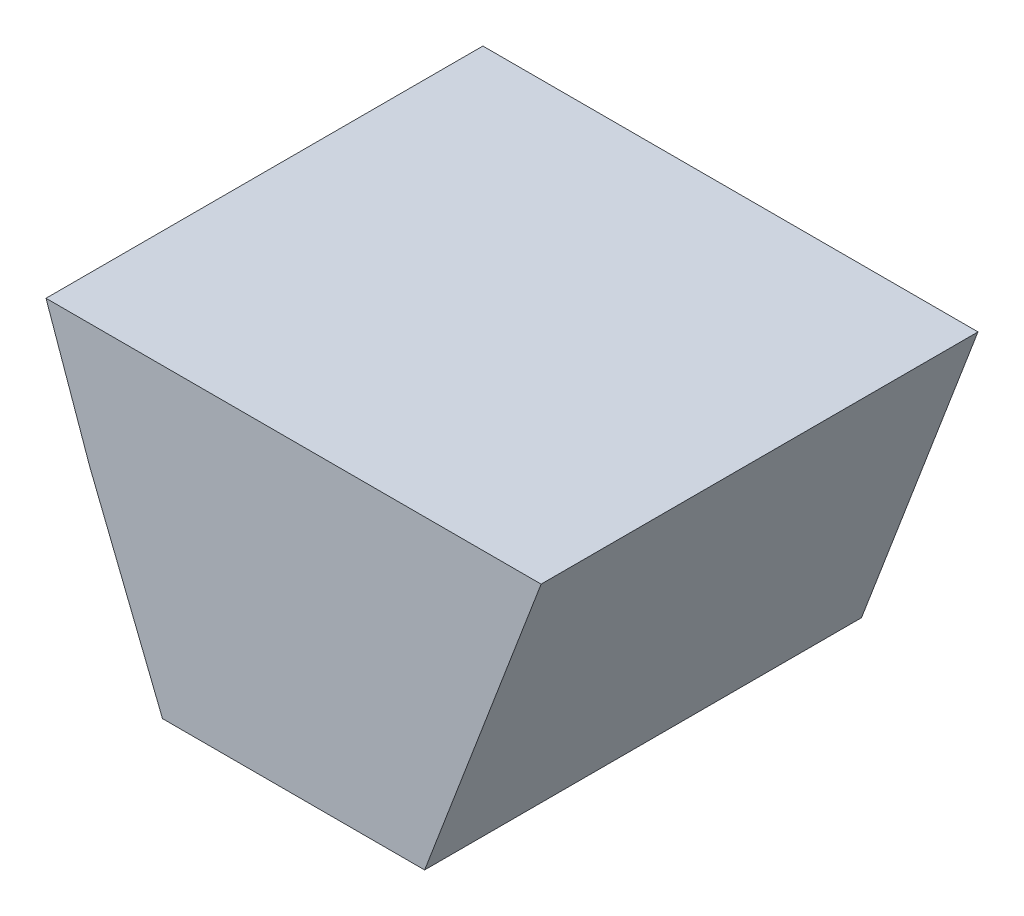
ISO-10303-21;
HEADER;
FILE_DESCRIPTION(('STEP AP214'),'2;1');
FILE_NAME('part.step','',(''),(''),'','','');
FILE_SCHEMA(('AUTOMOTIVE_DESIGN { 1 0 10303 214 1 1 1 1 }'));
ENDSEC;
DATA;
#1=APPLICATION_CONTEXT('core data for automotive mechanical design processes');
#2=APPLICATION_PROTOCOL_DEFINITION('international standard','automotive_design',2000,#1);
#3=PRODUCT_CONTEXT('',#1,'mechanical');
#4=PRODUCT('Part','Part','',(#3));
#5=PRODUCT_RELATED_PRODUCT_CATEGORY('part','',(#4));
#6=PRODUCT_DEFINITION_FORMATION('','',#4);
#7=PRODUCT_DEFINITION_CONTEXT('part definition',#1,'design');
#8=PRODUCT_DEFINITION('design','',#6,#7);
#9=PRODUCT_DEFINITION_SHAPE('','',#8);
#10=(LENGTH_UNIT() NAMED_UNIT(*) SI_UNIT(.MILLI.,.METRE.));
#11=(NAMED_UNIT(*) PLANE_ANGLE_UNIT() SI_UNIT($,.RADIAN.));
#12=(NAMED_UNIT(*) SI_UNIT($,.STERADIAN.) SOLID_ANGLE_UNIT());
#13=UNCERTAINTY_MEASURE_WITH_UNIT(LENGTH_MEASURE(1.E-05),#10,'distance_accuracy_value','');
#14=(GEOMETRIC_REPRESENTATION_CONTEXT(3) GLOBAL_UNCERTAINTY_ASSIGNED_CONTEXT((#13)) GLOBAL_UNIT_ASSIGNED_CONTEXT((#10,
#11,#12)) REPRESENTATION_CONTEXT('',''));
#15=CARTESIAN_POINT('',(0.,0.,0.));
#16=DIRECTION('',(0.,0.,1.));
#17=DIRECTION('',(1.,0.,0.));
#18=AXIS2_PLACEMENT_3D('',#15,#16,#17);
#19=CARTESIAN_POINT('',(-2.286,-2.667,0.));
#20=DIRECTION('',(0.,1.,0.));
#21=DIRECTION('',(0.,0.,1.));
#22=AXIS2_PLACEMENT_3D('',#19,#20,#21);
#23=PLANE('',#22);
#24=DIRECTION('',(0.,0.,1.));
#25=VECTOR('',#24,1.);
#26=CARTESIAN_POINT('',(2.286,-2.667,0.));
#27=LINE('',#26,#25);
#28=CARTESIAN_POINT('',(2.286,-2.667,0.));
#29=VERTEX_POINT('',#28);
#30=CARTESIAN_POINT('',(2.286,-2.667,7.62));
#31=VERTEX_POINT('',#30);
#32=EDGE_CURVE('E64',#29,#31,#27,.T.);
#33=ORIENTED_EDGE('',*,*,#32,.T.);
#34=DIRECTION('',(-1.,0.,0.));
#35=VECTOR('',#34,1.);
#36=CARTESIAN_POINT('',(-4.318,-2.667,7.62));
#37=LINE('',#36,#35);
#38=CARTESIAN_POINT('',(-2.286,-2.667,7.62));
#39=VERTEX_POINT('',#38);
#40=EDGE_CURVE('E66',#31,#39,#37,.T.);
#41=ORIENTED_EDGE('',*,*,#40,.T.);
#42=DIRECTION('',(0.,0.,1.));
#43=VECTOR('',#42,1.);
#44=CARTESIAN_POINT('',(-2.286,-2.667,0.));
#45=LINE('',#44,#43);
#46=CARTESIAN_POINT('',(-2.286,-2.667,0.));
#47=VERTEX_POINT('',#46);
#48=EDGE_CURVE('E19',#39,#47,#45,.F.);
#49=ORIENTED_EDGE('',*,*,#48,.T.);
#50=DIRECTION('',(-1.,0.,0.));
#51=VECTOR('',#50,1.);
#52=CARTESIAN_POINT('',(-4.318,-2.667,0.));
#53=LINE('',#52,#51);
#54=EDGE_CURVE('E67',#29,#47,#53,.T.);
#55=ORIENTED_EDGE('',*,*,#54,.F.);
#56=EDGE_LOOP('',(#33,#41,#49,#55));
#57=FACE_BOUND('',#56,.T.);
#58=ADVANCED_FACE('F16',(#57),#23,.F.);
#59=CARTESIAN_POINT('',(-3.556,0.508,0.));
#60=DIRECTION('',(0.928476690885259,0.371390676354104,0.));
#61=DIRECTION('',(-0.371390676354104,0.928476690885259,0.));
#62=AXIS2_PLACEMENT_3D('',#59,#60,#61);
#63=PLANE('',#62);
#64=ORIENTED_EDGE('',*,*,#48,.F.);
#65=DIRECTION('',(-0.371390676354104,0.928476690885259,0.));
#66=VECTOR('',#65,1.);
#67=CARTESIAN_POINT('',(-2.286,-2.667,7.62));
#68=LINE('',#67,#66);
#69=CARTESIAN_POINT('',(-3.55600000000016,0.508000000000151,7.62));
#70=VERTEX_POINT('',#69);
#71=EDGE_CURVE('E78',#39,#70,#68,.T.);
#72=ORIENTED_EDGE('',*,*,#71,.T.);
#73=DIRECTION('',(0.,0.,1.));
#74=VECTOR('',#73,1.);
#75=CARTESIAN_POINT('',(-3.55600000000036,0.507999999999873,0.));
#76=LINE('',#75,#74);
#77=CARTESIAN_POINT('',(-3.55600000000012,0.50800000000006,0.));
#78=VERTEX_POINT('',#77);
#79=EDGE_CURVE('E88',#70,#78,#76,.F.);
#80=ORIENTED_EDGE('',*,*,#79,.T.);
#81=DIRECTION('',(-0.371390676354104,0.928476690885259,0.));
#82=VECTOR('',#81,1.);
#83=CARTESIAN_POINT('',(-2.286,-2.667,0.));
#84=LINE('',#83,#82);
#85=EDGE_CURVE('E94',#47,#78,#84,.T.);
#86=ORIENTED_EDGE('',*,*,#85,.F.);
#87=EDGE_LOOP('',(#64,#72,#80,#86));
#88=FACE_BOUND('',#87,.T.);
#89=ADVANCED_FACE('F108',(#88),#63,.F.);
#90=CARTESIAN_POINT('',(2.286,-2.667,0.));
#91=DIRECTION('',(-0.934487734928968,0.355995327591988,0.));
#92=DIRECTION('',(-0.355995327591988,-0.934487734928968,0.));
#93=AXIS2_PLACEMENT_3D('',#90,#91,#92);
#94=PLANE('',#93);
#95=DIRECTION('',(0.,0.,-1.));
#96=VECTOR('',#95,1.);
#97=CARTESIAN_POINT('',(4.318,2.667,0.));
#98=LINE('',#97,#96);
#99=CARTESIAN_POINT('',(4.318,2.667,0.));
#100=VERTEX_POINT('',#99);
#101=CARTESIAN_POINT('',(4.318,2.667,7.62));
#102=VERTEX_POINT('',#101);
#103=EDGE_CURVE('E82',#100,#102,#98,.F.);
#104=ORIENTED_EDGE('',*,*,#103,.T.);
#105=DIRECTION('',(-0.355995327591988,-0.934487734928968,0.));
#106=VECTOR('',#105,1.);
#107=CARTESIAN_POINT('',(4.318,2.667,7.62));
#108=LINE('',#107,#106);
#109=EDGE_CURVE('E72',#102,#31,#108,.T.);
#110=ORIENTED_EDGE('',*,*,#109,.T.);
#111=ORIENTED_EDGE('',*,*,#32,.F.);
#112=DIRECTION('',(-0.355995327591988,-0.934487734928968,0.));
#113=VECTOR('',#112,1.);
#114=CARTESIAN_POINT('',(4.318,2.667,0.));
#115=LINE('',#114,#113);
#116=EDGE_CURVE('E91',#100,#29,#115,.T.);
#117=ORIENTED_EDGE('',*,*,#116,.F.);
#118=EDGE_LOOP('',(#104,#110,#111,#117));
#119=FACE_BOUND('',#118,.T.);
#120=ADVANCED_FACE('F81',(#119),#94,.F.);
#121=CARTESIAN_POINT('',(-4.318,2.667,7.62));
#122=DIRECTION('',(0.,0.,-1.));
#123=DIRECTION('',(-1.,0.,0.));
#124=AXIS2_PLACEMENT_3D('',#121,#122,#123);
#125=PLANE('',#124);
#126=ORIENTED_EDGE('',*,*,#71,.F.);
#127=ORIENTED_EDGE('',*,*,#40,.F.);
#128=ORIENTED_EDGE('',*,*,#109,.F.);
#129=DIRECTION('',(1.,0.,0.));
#130=VECTOR('',#129,1.);
#131=CARTESIAN_POINT('',(4.318,2.667,7.62));
#132=LINE('',#131,#130);
#133=CARTESIAN_POINT('',(-4.318,2.667,7.62));
#134=VERTEX_POINT('',#133);
#135=EDGE_CURVE('E98',#102,#134,#132,.F.);
#136=ORIENTED_EDGE('',*,*,#135,.T.);
#137=DIRECTION('',(-0.332820117734981,0.942990333582945,0.));
#138=VECTOR('',#137,1.);
#139=CARTESIAN_POINT('',(-4.318,2.667,7.62));
#140=LINE('',#139,#138);
#141=EDGE_CURVE('E86',#134,#70,#140,.F.);
#142=ORIENTED_EDGE('',*,*,#141,.T.);
#143=EDGE_LOOP('',(#126,#127,#128,#136,#142));
#144=FACE_BOUND('',#143,.T.);
#145=ADVANCED_FACE('F74',(#144),#125,.F.);
#146=CARTESIAN_POINT('',(-4.318,2.667,0.));
#147=DIRECTION('',(0.942990333582945,0.332820117734981,0.));
#148=DIRECTION('',(-0.332820117734981,0.942990333582945,0.));
#149=AXIS2_PLACEMENT_3D('',#146,#147,#148);
#150=PLANE('',#149);
#151=ORIENTED_EDGE('',*,*,#79,.F.);
#152=ORIENTED_EDGE('',*,*,#141,.F.);
#153=DIRECTION('',(0.,0.,-1.));
#154=VECTOR('',#153,1.);
#155=CARTESIAN_POINT('',(-4.318,2.667,0.));
#156=LINE('',#155,#154);
#157=CARTESIAN_POINT('',(-4.318,2.667,0.));
#158=VERTEX_POINT('',#157);
#159=EDGE_CURVE('E25',#134,#158,#156,.T.);
#160=ORIENTED_EDGE('',*,*,#159,.T.);
#161=DIRECTION('',(-0.332820117735137,0.942990333582889,0.));
#162=VECTOR('',#161,1.);
#163=CARTESIAN_POINT('',(-3.556,0.508,0.));
#164=LINE('',#163,#162);
#165=EDGE_CURVE('E33',#78,#158,#164,.T.);
#166=ORIENTED_EDGE('',*,*,#165,.F.);
#167=EDGE_LOOP('',(#151,#152,#160,#166));
#168=FACE_BOUND('',#167,.T.);
#169=ADVANCED_FACE('F104',(#168),#150,.F.);
#170=CARTESIAN_POINT('',(-4.318,2.667,0.));
#171=DIRECTION('',(0.,0.,-1.));
#172=DIRECTION('',(-1.,0.,0.));
#173=AXIS2_PLACEMENT_3D('',#170,#171,#172);
#174=PLANE('',#173);
#175=ORIENTED_EDGE('',*,*,#85,.T.);
#176=ORIENTED_EDGE('',*,*,#165,.T.);
#177=DIRECTION('',(1.,0.,0.));
#178=VECTOR('',#177,1.);
#179=CARTESIAN_POINT('',(4.318,2.667,0.));
#180=LINE('',#179,#178);
#181=EDGE_CURVE('E11',#158,#100,#180,.T.);
#182=ORIENTED_EDGE('',*,*,#181,.T.);
#183=ORIENTED_EDGE('',*,*,#116,.T.);
#184=ORIENTED_EDGE('',*,*,#54,.T.);
#185=EDGE_LOOP('',(#175,#176,#182,#183,#184));
#186=FACE_BOUND('',#185,.T.);
#187=ADVANCED_FACE('F107',(#186),#174,.T.);
#188=CARTESIAN_POINT('',(4.318,2.667,0.));
#189=DIRECTION('',(0.,-1.,0.));
#190=DIRECTION('',(0.,0.,-1.));
#191=AXIS2_PLACEMENT_3D('',#188,#189,#190);
#192=PLANE('',#191);
#193=ORIENTED_EDGE('',*,*,#159,.F.);
#194=ORIENTED_EDGE('',*,*,#135,.F.);
#195=ORIENTED_EDGE('',*,*,#103,.F.);
#196=ORIENTED_EDGE('',*,*,#181,.F.);
#197=EDGE_LOOP('',(#193,#194,#195,#196));
#198=FACE_BOUND('',#197,.T.);
#199=ADVANCED_FACE('F106',(#198),#192,.F.);
#200=CLOSED_SHELL('',(#58,#89,#120,#145,#169,#187,#199));
#201=MANIFOLD_SOLID_BREP('B1',#200);
#202=ADVANCED_BREP_SHAPE_REPRESENTATION('',(#18,#201),#14);
#203=SHAPE_DEFINITION_REPRESENTATION(#9,#202);
ENDSEC;
END-ISO-10303-21;
